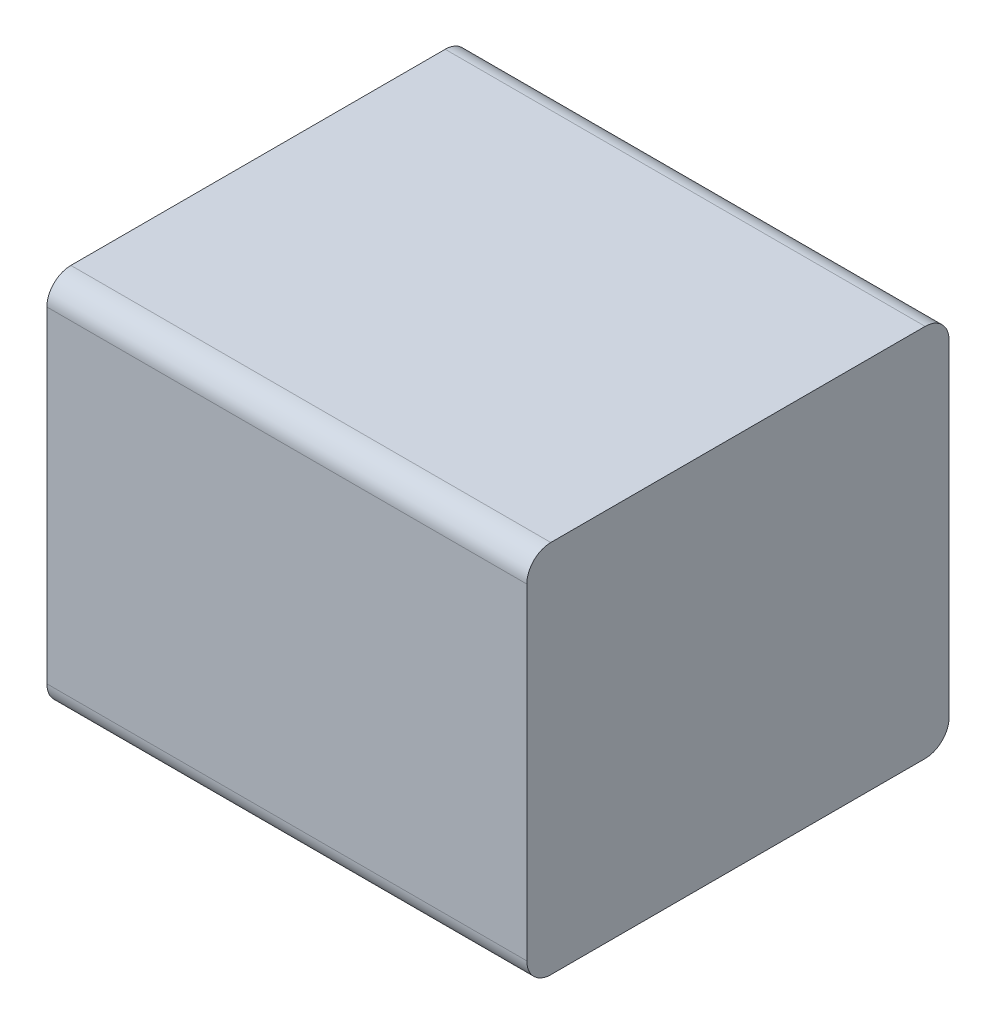
ISO-10303-21;
HEADER;
FILE_DESCRIPTION(('STEP AP214'),'2;1');
FILE_NAME('part.step','',(''),(''),'','','');
FILE_SCHEMA(('AUTOMOTIVE_DESIGN { 1 0 10303 214 1 1 1 1 }'));
ENDSEC;
DATA;
#1=APPLICATION_CONTEXT('core data for automotive mechanical design processes');
#2=APPLICATION_PROTOCOL_DEFINITION('international standard','automotive_design',2000,#1);
#3=PRODUCT_CONTEXT('',#1,'mechanical');
#4=PRODUCT('Part','Part','',(#3));
#5=PRODUCT_RELATED_PRODUCT_CATEGORY('part','',(#4));
#6=PRODUCT_DEFINITION_FORMATION('','',#4);
#7=PRODUCT_DEFINITION_CONTEXT('part definition',#1,'design');
#8=PRODUCT_DEFINITION('design','',#6,#7);
#9=PRODUCT_DEFINITION_SHAPE('','',#8);
#10=(LENGTH_UNIT() NAMED_UNIT(*) SI_UNIT(.MILLI.,.METRE.));
#11=(NAMED_UNIT(*) PLANE_ANGLE_UNIT() SI_UNIT($,.RADIAN.));
#12=(NAMED_UNIT(*) SI_UNIT($,.STERADIAN.) SOLID_ANGLE_UNIT());
#13=UNCERTAINTY_MEASURE_WITH_UNIT(LENGTH_MEASURE(1.E-05),#10,'distance_accuracy_value','');
#14=(GEOMETRIC_REPRESENTATION_CONTEXT(3) GLOBAL_UNCERTAINTY_ASSIGNED_CONTEXT((#13)) GLOBAL_UNIT_ASSIGNED_CONTEXT((#10,
#11,#12)) REPRESENTATION_CONTEXT('',''));
#15=CARTESIAN_POINT('',(0.,0.,0.));
#16=DIRECTION('',(0.,0.,1.));
#17=DIRECTION('',(1.,0.,0.));
#18=AXIS2_PLACEMENT_3D('',#15,#16,#17);
#19=CARTESIAN_POINT('',(0.,-0.34,0.0599999999999962));
#20=DIRECTION('',(1.,0.,0.));
#21=DIRECTION('',(0.,0.,-1.));
#22=AXIS2_PLACEMENT_3D('',#19,#20,#21);
#23=CYLINDRICAL_SURFACE('',#22,0.05);
#24=CARTESIAN_POINT('',(-0.499999999999989,-0.34,0.0599999999999926));
#25=DIRECTION('',(-1.,0.,0.));
#26=DIRECTION('',(0.,0.,-1.));
#27=AXIS2_PLACEMENT_3D('',#24,#25,#26);
#28=CIRCLE('',#27,0.05);
#29=CARTESIAN_POINT('',(-0.499999999999989,-0.34,0.00999999999999254));
#30=VERTEX_POINT('',#29);
#31=CARTESIAN_POINT('',(-0.499999999999989,-0.39,0.0599999999999962));
#32=VERTEX_POINT('',#31);
#33=EDGE_CURVE('E136',#30,#32,#28,.T.);
#34=ORIENTED_EDGE('',*,*,#33,.F.);
#35=DIRECTION('',(-1.,0.,0.));
#36=VECTOR('',#35,1.);
#37=CARTESIAN_POINT('',(0.,-0.34,0.00999999999999619));
#38=LINE('',#37,#36);
#39=CARTESIAN_POINT('',(0.5,-0.34,0.00999999999999984));
#40=VERTEX_POINT('',#39);
#41=EDGE_CURVE('E11',#40,#30,#38,.T.);
#42=ORIENTED_EDGE('',*,*,#41,.F.);
#43=CARTESIAN_POINT('',(0.5,-0.34,0.06));
#44=DIRECTION('',(1.,0.,0.));
#45=DIRECTION('',(0.,0.,-1.));
#46=AXIS2_PLACEMENT_3D('',#43,#44,#45);
#47=CIRCLE('',#46,0.05);
#48=CARTESIAN_POINT('',(0.5,-0.39,0.06));
#49=VERTEX_POINT('',#48);
#50=EDGE_CURVE('E277',#49,#40,#47,.T.);
#51=ORIENTED_EDGE('',*,*,#50,.F.);
#52=DIRECTION('',(-1.,0.,0.));
#53=VECTOR('',#52,1.);
#54=CARTESIAN_POINT('',(0.,-0.39,0.06));
#55=LINE('',#54,#53);
#56=EDGE_CURVE('E158',#49,#32,#55,.T.);
#57=ORIENTED_EDGE('',*,*,#56,.T.);
#58=EDGE_LOOP('',(#34,#42,#51,#57));
#59=FACE_BOUND('',#58,.T.);
#60=ADVANCED_FACE('F17',(#59),#23,.T.);
#61=CARTESIAN_POINT('',(0.,-0.39,0.00999999999999619));
#62=DIRECTION('',(0.,0.,-1.));
#63=DIRECTION('',(0.,-1.,0.));
#64=AXIS2_PLACEMENT_3D('',#61,#62,#63);
#65=PLANE('',#64);
#66=DIRECTION('',(-1.,0.,0.));
#67=VECTOR('',#66,1.);
#68=CARTESIAN_POINT('',(0.,0.34,0.0099999999999962));
#69=LINE('',#68,#67);
#70=CARTESIAN_POINT('',(0.5,0.34,0.00999999999999984));
#71=VERTEX_POINT('',#70);
#72=CARTESIAN_POINT('',(-0.499999999999989,0.34,0.00999999999999253));
#73=VERTEX_POINT('',#72);
#74=EDGE_CURVE('E151',#71,#73,#69,.T.);
#75=ORIENTED_EDGE('',*,*,#74,.F.);
#76=DIRECTION('',(0.,1.,0.));
#77=VECTOR('',#76,1.);
#78=CARTESIAN_POINT('',(0.5,-0.39,0.00999999999999986));
#79=LINE('',#78,#77);
#80=EDGE_CURVE('E126',#40,#71,#79,.T.);
#81=ORIENTED_EDGE('',*,*,#80,.F.);
#82=ORIENTED_EDGE('',*,*,#41,.T.);
#83=DIRECTION('',(0.,-1.,0.));
#84=VECTOR('',#83,1.);
#85=CARTESIAN_POINT('',(-0.499999999999989,-0.39,0.00999999999999249));
#86=LINE('',#85,#84);
#87=EDGE_CURVE('E135',#73,#30,#86,.T.);
#88=ORIENTED_EDGE('',*,*,#87,.F.);
#89=EDGE_LOOP('',(#75,#81,#82,#88));
#90=FACE_BOUND('',#89,.T.);
#91=ADVANCED_FACE('F320',(#90),#65,.T.);
#92=CARTESIAN_POINT('',(0.,-0.39,0.89));
#93=DIRECTION('',(0.,0.,1.));
#94=DIRECTION('',(1.,0.,0.));
#95=AXIS2_PLACEMENT_3D('',#92,#93,#94);
#96=PLANE('',#95);
#97=DIRECTION('',(-1.,0.,0.));
#98=VECTOR('',#97,1.);
#99=CARTESIAN_POINT('',(0.,-0.34,0.89));
#100=LINE('',#99,#98);
#101=CARTESIAN_POINT('',(0.50000000000001,-0.34,0.89));
#102=VERTEX_POINT('',#101);
#103=CARTESIAN_POINT('',(-0.499999999999989,-0.34,0.89));
#104=VERTEX_POINT('',#103);
#105=EDGE_CURVE('E26',#102,#104,#100,.T.);
#106=ORIENTED_EDGE('',*,*,#105,.F.);
#107=DIRECTION('',(0.,-1.,0.));
#108=VECTOR('',#107,1.);
#109=CARTESIAN_POINT('',(0.50000000000001,-0.39,0.89));
#110=LINE('',#109,#108);
#111=CARTESIAN_POINT('',(0.500000000000011,0.34,0.89));
#112=VERTEX_POINT('',#111);
#113=EDGE_CURVE('E109',#112,#102,#110,.T.);
#114=ORIENTED_EDGE('',*,*,#113,.F.);
#115=DIRECTION('',(1.,0.,0.));
#116=VECTOR('',#115,1.);
#117=CARTESIAN_POINT('',(0.,0.34,0.89));
#118=LINE('',#117,#116);
#119=CARTESIAN_POINT('',(-0.499999999999989,0.34,0.89));
#120=VERTEX_POINT('',#119);
#121=EDGE_CURVE('E95',#120,#112,#118,.T.);
#122=ORIENTED_EDGE('',*,*,#121,.F.);
#123=DIRECTION('',(0.,1.,0.));
#124=VECTOR('',#123,1.);
#125=CARTESIAN_POINT('',(-0.499999999999989,-0.39,0.89));
#126=LINE('',#125,#124);
#127=EDGE_CURVE('E148',#104,#120,#126,.T.);
#128=ORIENTED_EDGE('',*,*,#127,.F.);
#129=EDGE_LOOP('',(#106,#114,#122,#128));
#130=FACE_BOUND('',#129,.T.);
#131=ADVANCED_FACE('F110',(#130),#96,.T.);
#132=CARTESIAN_POINT('',(0.,-0.34,0.84));
#133=DIRECTION('',(-1.,0.,0.));
#134=DIRECTION('',(0.,0.,1.));
#135=AXIS2_PLACEMENT_3D('',#132,#133,#134);
#136=CYLINDRICAL_SURFACE('',#135,0.05);
#137=CARTESIAN_POINT('',(0.50000000000001,-0.34,0.84));
#138=DIRECTION('',(1.,0.,0.));
#139=DIRECTION('',(0.,0.,1.));
#140=AXIS2_PLACEMENT_3D('',#137,#138,#139);
#141=CIRCLE('',#140,0.05);
#142=CARTESIAN_POINT('',(0.50000000000001,-0.39,0.84));
#143=VERTEX_POINT('',#142);
#144=EDGE_CURVE('E241',#102,#143,#141,.T.);
#145=ORIENTED_EDGE('',*,*,#144,.F.);
#146=ORIENTED_EDGE('',*,*,#105,.T.);
#147=CARTESIAN_POINT('',(-0.499999999999989,-0.34,0.84));
#148=DIRECTION('',(-1.,0.,0.));
#149=DIRECTION('',(0.,0.,1.));
#150=AXIS2_PLACEMENT_3D('',#147,#148,#149);
#151=CIRCLE('',#150,0.05);
#152=CARTESIAN_POINT('',(-0.499999999999989,-0.39,0.84));
#153=VERTEX_POINT('',#152);
#154=EDGE_CURVE('E144',#153,#104,#151,.T.);
#155=ORIENTED_EDGE('',*,*,#154,.F.);
#156=DIRECTION('',(1.,0.,0.));
#157=VECTOR('',#156,1.);
#158=CARTESIAN_POINT('',(0.,-0.39,0.84));
#159=LINE('',#158,#157);
#160=EDGE_CURVE('E155',#153,#143,#159,.T.);
#161=ORIENTED_EDGE('',*,*,#160,.T.);
#162=EDGE_LOOP('',(#145,#146,#155,#161));
#163=FACE_BOUND('',#162,.T.);
#164=ADVANCED_FACE('F356',(#163),#136,.T.);
#165=CARTESIAN_POINT('',(0.,-0.39,0.45));
#166=DIRECTION('',(0.,1.,0.));
#167=DIRECTION('',(0.,0.,-1.));
#168=AXIS2_PLACEMENT_3D('',#165,#166,#167);
#169=PLANE('',#168);
#170=DIRECTION('',(0.,0.,-1.));
#171=VECTOR('',#170,1.);
#172=CARTESIAN_POINT('',(0.5,-0.39,0.45));
#173=LINE('',#172,#171);
#174=EDGE_CURVE('E264',#143,#49,#173,.T.);
#175=ORIENTED_EDGE('',*,*,#174,.F.);
#176=ORIENTED_EDGE('',*,*,#160,.F.);
#177=DIRECTION('',(0.,0.,1.));
#178=VECTOR('',#177,1.);
#179=CARTESIAN_POINT('',(-0.499999999999989,-0.39,0.449999999999993));
#180=LINE('',#179,#178);
#181=EDGE_CURVE('E140',#32,#153,#180,.T.);
#182=ORIENTED_EDGE('',*,*,#181,.F.);
#183=ORIENTED_EDGE('',*,*,#56,.F.);
#184=EDGE_LOOP('',(#175,#176,#182,#183));
#185=FACE_BOUND('',#184,.T.);
#186=ADVANCED_FACE('F379',(#185),#169,.F.);
#187=CARTESIAN_POINT('',(0.,0.34,0.0599999999999962));
#188=DIRECTION('',(1.,0.,0.));
#189=DIRECTION('',(0.,0.,-1.));
#190=AXIS2_PLACEMENT_3D('',#187,#188,#189);
#191=CYLINDRICAL_SURFACE('',#190,0.05);
#192=CARTESIAN_POINT('',(-0.499999999999989,0.34,0.0599999999999926));
#193=DIRECTION('',(-1.,0.,0.));
#194=DIRECTION('',(0.,0.,-1.));
#195=AXIS2_PLACEMENT_3D('',#192,#193,#194);
#196=CIRCLE('',#195,0.05);
#197=CARTESIAN_POINT('',(-0.499999999999989,0.39,0.0599999999999962));
#198=VERTEX_POINT('',#197);
#199=EDGE_CURVE('E106',#198,#73,#196,.T.);
#200=ORIENTED_EDGE('',*,*,#199,.F.);
#201=DIRECTION('',(-1.,0.,0.));
#202=VECTOR('',#201,1.);
#203=CARTESIAN_POINT('',(0.,0.39,0.06));
#204=LINE('',#203,#202);
#205=CARTESIAN_POINT('',(0.5,0.39,0.06));
#206=VERTEX_POINT('',#205);
#207=EDGE_CURVE('E242',#206,#198,#204,.T.);
#208=ORIENTED_EDGE('',*,*,#207,.F.);
#209=CARTESIAN_POINT('',(0.5,0.34,0.06));
#210=DIRECTION('',(1.,0.,0.));
#211=DIRECTION('',(0.,0.,-1.));
#212=AXIS2_PLACEMENT_3D('',#209,#210,#211);
#213=CIRCLE('',#212,0.05);
#214=EDGE_CURVE('E120',#71,#206,#213,.T.);
#215=ORIENTED_EDGE('',*,*,#214,.F.);
#216=ORIENTED_EDGE('',*,*,#74,.T.);
#217=EDGE_LOOP('',(#200,#208,#215,#216));
#218=FACE_BOUND('',#217,.T.);
#219=ADVANCED_FACE('F367',(#218),#191,.T.);
#220=CARTESIAN_POINT('',(-0.499999999999989,-0.39,0.449999999999993));
#221=DIRECTION('',(-1.,0.,0.));
#222=DIRECTION('',(0.,0.,1.));
#223=AXIS2_PLACEMENT_3D('',#220,#221,#222);
#224=PLANE('',#223);
#225=ORIENTED_EDGE('',*,*,#199,.T.);
#226=ORIENTED_EDGE('',*,*,#87,.T.);
#227=ORIENTED_EDGE('',*,*,#33,.T.);
#228=ORIENTED_EDGE('',*,*,#181,.T.);
#229=ORIENTED_EDGE('',*,*,#154,.T.);
#230=ORIENTED_EDGE('',*,*,#127,.T.);
#231=CARTESIAN_POINT('',(-0.499999999999989,0.34,0.84));
#232=DIRECTION('',(1.,0.,0.));
#233=DIRECTION('',(0.,0.,1.));
#234=AXIS2_PLACEMENT_3D('',#231,#232,#233);
#235=CIRCLE('',#234,0.05);
#236=CARTESIAN_POINT('',(-0.499999999999989,0.39,0.84));
#237=VERTEX_POINT('',#236);
#238=EDGE_CURVE('E103',#237,#120,#235,.T.);
#239=ORIENTED_EDGE('',*,*,#238,.F.);
#240=DIRECTION('',(0.,0.,1.));
#241=VECTOR('',#240,1.);
#242=CARTESIAN_POINT('',(-0.499999999999989,0.39,0.45));
#243=LINE('',#242,#241);
#244=EDGE_CURVE('E237',#198,#237,#243,.T.);
#245=ORIENTED_EDGE('',*,*,#244,.F.);
#246=EDGE_LOOP('',(#225,#226,#227,#228,#229,#230,#239,#245));
#247=FACE_BOUND('',#246,.T.);
#248=ADVANCED_FACE('F345',(#247),#224,.T.);
#249=CARTESIAN_POINT('',(0.,0.34,0.84));
#250=DIRECTION('',(-1.,0.,0.));
#251=DIRECTION('',(0.,0.,1.));
#252=AXIS2_PLACEMENT_3D('',#249,#250,#251);
#253=CYLINDRICAL_SURFACE('',#252,0.05);
#254=CARTESIAN_POINT('',(0.500000000000011,0.34,0.84));
#255=DIRECTION('',(1.,0.,0.));
#256=DIRECTION('',(0.,0.,1.));
#257=AXIS2_PLACEMENT_3D('',#254,#255,#256);
#258=CIRCLE('',#257,0.05);
#259=CARTESIAN_POINT('',(0.50000000000001,0.39,0.84));
#260=VERTEX_POINT('',#259);
#261=EDGE_CURVE('E100',#260,#112,#258,.T.);
#262=ORIENTED_EDGE('',*,*,#261,.F.);
#263=DIRECTION('',(1.,0.,0.));
#264=VECTOR('',#263,1.);
#265=CARTESIAN_POINT('',(0.,0.39,0.84));
#266=LINE('',#265,#264);
#267=EDGE_CURVE('E228',#237,#260,#266,.T.);
#268=ORIENTED_EDGE('',*,*,#267,.F.);
#269=ORIENTED_EDGE('',*,*,#238,.T.);
#270=ORIENTED_EDGE('',*,*,#121,.T.);
#271=EDGE_LOOP('',(#262,#268,#269,#270));
#272=FACE_BOUND('',#271,.T.);
#273=ADVANCED_FACE('F97',(#272),#253,.T.);
#274=CARTESIAN_POINT('',(0.5,-0.39,0.45));
#275=DIRECTION('',(1.,0.,0.));
#276=DIRECTION('',(0.,0.,-1.));
#277=AXIS2_PLACEMENT_3D('',#274,#275,#276);
#278=PLANE('',#277);
#279=ORIENTED_EDGE('',*,*,#144,.T.);
#280=ORIENTED_EDGE('',*,*,#174,.T.);
#281=ORIENTED_EDGE('',*,*,#50,.T.);
#282=ORIENTED_EDGE('',*,*,#80,.T.);
#283=ORIENTED_EDGE('',*,*,#214,.T.);
#284=DIRECTION('',(0.,0.,-1.));
#285=VECTOR('',#284,1.);
#286=CARTESIAN_POINT('',(0.50000000000001,0.39,0.45));
#287=LINE('',#286,#285);
#288=EDGE_CURVE('E117',#260,#206,#287,.T.);
#289=ORIENTED_EDGE('',*,*,#288,.F.);
#290=ORIENTED_EDGE('',*,*,#261,.T.);
#291=ORIENTED_EDGE('',*,*,#113,.T.);
#292=EDGE_LOOP('',(#279,#280,#281,#282,#283,#289,#290,#291));
#293=FACE_BOUND('',#292,.T.);
#294=ADVANCED_FACE('F115',(#293),#278,.T.);
#295=CARTESIAN_POINT('',(0.,0.39,0.45));
#296=DIRECTION('',(0.,1.,0.));
#297=DIRECTION('',(0.,0.,-1.));
#298=AXIS2_PLACEMENT_3D('',#295,#296,#297);
#299=PLANE('',#298);
#300=ORIENTED_EDGE('',*,*,#267,.T.);
#301=ORIENTED_EDGE('',*,*,#288,.T.);
#302=ORIENTED_EDGE('',*,*,#207,.T.);
#303=ORIENTED_EDGE('',*,*,#244,.T.);
#304=EDGE_LOOP('',(#300,#301,#302,#303));
#305=FACE_BOUND('',#304,.T.);
#306=ADVANCED_FACE('F306',(#305),#299,.T.);
#307=CLOSED_SHELL('',(#60,#91,#131,#164,#186,#219,#248,#273,#294,#306));
#308=MANIFOLD_SOLID_BREP('B1',#307);
#309=ADVANCED_BREP_SHAPE_REPRESENTATION('',(#18,#308),#14);
#310=SHAPE_DEFINITION_REPRESENTATION(#9,#309);
ENDSEC;
END-ISO-10303-21;
